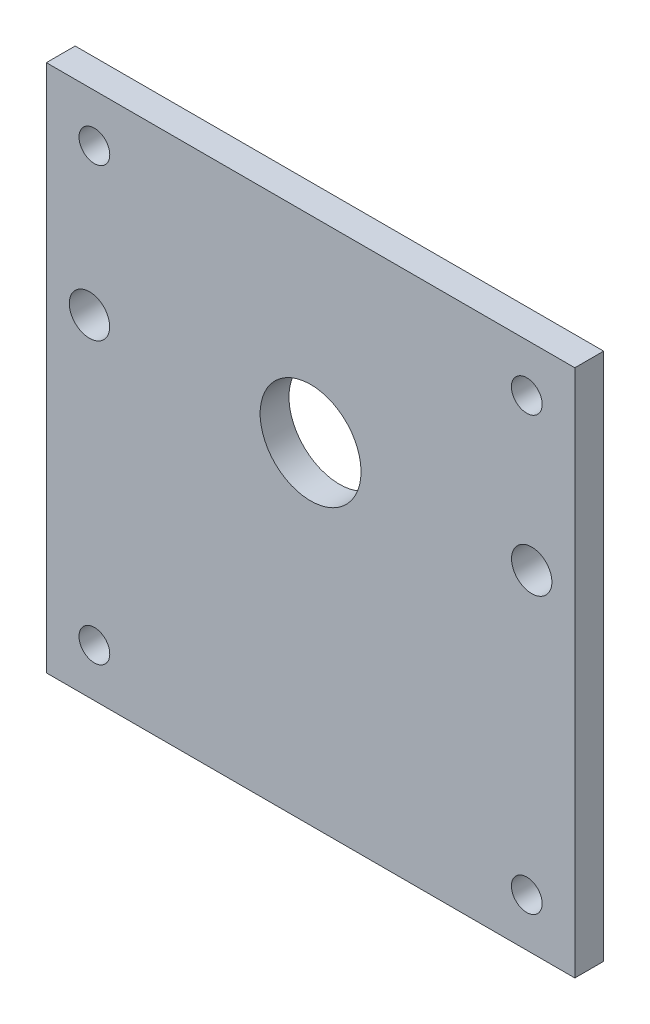
ISO-10303-21;
HEADER;
FILE_DESCRIPTION(('STEP AP214'),'2;1');
FILE_NAME('part.step','',(''),(''),'','','');
FILE_SCHEMA(('AUTOMOTIVE_DESIGN { 1 0 10303 214 1 1 1 1 }'));
ENDSEC;
DATA;
#1=APPLICATION_CONTEXT('core data for automotive mechanical design processes');
#2=APPLICATION_PROTOCOL_DEFINITION('international standard','automotive_design',2000,#1);
#3=PRODUCT_CONTEXT('',#1,'mechanical');
#4=PRODUCT('Part','Part','',(#3));
#5=PRODUCT_RELATED_PRODUCT_CATEGORY('part','',(#4));
#6=PRODUCT_DEFINITION_FORMATION('','',#4);
#7=PRODUCT_DEFINITION_CONTEXT('part definition',#1,'design');
#8=PRODUCT_DEFINITION('design','',#6,#7);
#9=PRODUCT_DEFINITION_SHAPE('','',#8);
#10=(LENGTH_UNIT() NAMED_UNIT(*) SI_UNIT(.MILLI.,.METRE.));
#11=(NAMED_UNIT(*) PLANE_ANGLE_UNIT() SI_UNIT($,.RADIAN.));
#12=(NAMED_UNIT(*) SI_UNIT($,.STERADIAN.) SOLID_ANGLE_UNIT());
#13=UNCERTAINTY_MEASURE_WITH_UNIT(LENGTH_MEASURE(1.E-05),#10,'distance_accuracy_value','');
#14=(GEOMETRIC_REPRESENTATION_CONTEXT(3) GLOBAL_UNCERTAINTY_ASSIGNED_CONTEXT((#13)) GLOBAL_UNIT_ASSIGNED_CONTEXT((#10,
#11,#12)) REPRESENTATION_CONTEXT('',''));
#15=CARTESIAN_POINT('',(0.,0.,0.));
#16=DIRECTION('',(0.,0.,1.));
#17=DIRECTION('',(1.,0.,0.));
#18=AXIS2_PLACEMENT_3D('',#15,#16,#17);
#19=CARTESIAN_POINT('',(0.,0.,3.));
#20=DIRECTION('',(0.,0.,1.));
#21=DIRECTION('',(1.,0.,0.));
#22=AXIS2_PLACEMENT_3D('',#19,#20,#21);
#23=PLANE('',#22);
#24=CARTESIAN_POINT('',(-22.5,-22.5,3.));
#25=DIRECTION('',(0.,0.,1.));
#26=DIRECTION('',(1.,0.,0.));
#27=AXIS2_PLACEMENT_3D('',#24,#25,#26);
#28=CIRCLE('',#27,1.6);
#29=CARTESIAN_POINT('',(-20.9,-22.5,3.));
#30=VERTEX_POINT('',#29);
#31=EDGE_CURVE('E170',#30,#30,#28,.T.);
#32=ORIENTED_EDGE('',*,*,#31,.F.);
#33=EDGE_LOOP('',(#32));
#34=FACE_BOUND('',#33,.T.);
#35=CARTESIAN_POINT('',(-22.5,22.5,3.));
#36=DIRECTION('',(0.,0.,1.));
#37=DIRECTION('',(1.,0.,0.));
#38=AXIS2_PLACEMENT_3D('',#35,#36,#37);
#39=CIRCLE('',#38,1.6);
#40=CARTESIAN_POINT('',(-20.9,22.5,3.));
#41=VERTEX_POINT('',#40);
#42=EDGE_CURVE('E154',#41,#41,#39,.T.);
#43=ORIENTED_EDGE('',*,*,#42,.F.);
#44=EDGE_LOOP('',(#43));
#45=FACE_BOUND('',#44,.T.);
#46=CARTESIAN_POINT('',(-23.0125,7.,3.));
#47=DIRECTION('',(0.,0.,1.));
#48=DIRECTION('',(1.,0.,0.));
#49=AXIS2_PLACEMENT_3D('',#46,#47,#48);
#50=CIRCLE('',#49,2.1);
#51=CARTESIAN_POINT('',(-20.9125,7.,3.));
#52=VERTEX_POINT('',#51);
#53=EDGE_CURVE('E138',#52,#52,#50,.T.);
#54=ORIENTED_EDGE('',*,*,#53,.F.);
#55=EDGE_LOOP('',(#54));
#56=FACE_BOUND('',#55,.T.);
#57=DIRECTION('',(0.,1.,0.));
#58=VECTOR('',#57,1.);
#59=CARTESIAN_POINT('',(27.5,27.5,3.));
#60=LINE('',#59,#58);
#61=CARTESIAN_POINT('',(27.5,-27.5,3.));
#62=VERTEX_POINT('',#61);
#63=CARTESIAN_POINT('',(27.5,27.5,3.));
#64=VERTEX_POINT('',#63);
#65=EDGE_CURVE('E96',#62,#64,#60,.T.);
#66=ORIENTED_EDGE('',*,*,#65,.T.);
#67=DIRECTION('',(-1.,0.,0.));
#68=VECTOR('',#67,1.);
#69=CARTESIAN_POINT('',(-27.5,27.5,3.));
#70=LINE('',#69,#68);
#71=CARTESIAN_POINT('',(-27.5,27.5,3.));
#72=VERTEX_POINT('',#71);
#73=EDGE_CURVE('E91',#64,#72,#70,.T.);
#74=ORIENTED_EDGE('',*,*,#73,.T.);
#75=DIRECTION('',(0.,-1.,0.));
#76=VECTOR('',#75,1.);
#77=CARTESIAN_POINT('',(-27.5,27.5,3.));
#78=LINE('',#77,#76);
#79=CARTESIAN_POINT('',(-27.5,-27.5,3.));
#80=VERTEX_POINT('',#79);
#81=EDGE_CURVE('E94',#72,#80,#78,.T.);
#82=ORIENTED_EDGE('',*,*,#81,.T.);
#83=DIRECTION('',(1.,0.,0.));
#84=VECTOR('',#83,1.);
#85=CARTESIAN_POINT('',(-27.5,-27.5,3.));
#86=LINE('',#85,#84);
#87=EDGE_CURVE('E61',#80,#62,#86,.T.);
#88=ORIENTED_EDGE('',*,*,#87,.T.);
#89=EDGE_LOOP('',(#66,#74,#82,#88));
#90=FACE_BOUND('',#89,.T.);
#91=CARTESIAN_POINT('',(0.,7.,3.));
#92=DIRECTION('',(0.,0.,1.));
#93=DIRECTION('',(1.,0.,0.));
#94=AXIS2_PLACEMENT_3D('',#91,#92,#93);
#95=CIRCLE('',#94,5.25);
#96=CARTESIAN_POINT('',(5.25,7.,3.));
#97=VERTEX_POINT('',#96);
#98=EDGE_CURVE('E116',#97,#97,#95,.T.);
#99=ORIENTED_EDGE('',*,*,#98,.F.);
#100=EDGE_LOOP('',(#99));
#101=FACE_BOUND('',#100,.T.);
#102=CARTESIAN_POINT('',(23.0125,7.,3.));
#103=DIRECTION('',(0.,0.,1.));
#104=DIRECTION('',(1.,0.,0.));
#105=AXIS2_PLACEMENT_3D('',#102,#103,#104);
#106=CIRCLE('',#105,2.1);
#107=CARTESIAN_POINT('',(25.1125,7.,3.));
#108=VERTEX_POINT('',#107);
#109=EDGE_CURVE('E146',#108,#108,#106,.T.);
#110=ORIENTED_EDGE('',*,*,#109,.F.);
#111=EDGE_LOOP('',(#110));
#112=FACE_BOUND('',#111,.T.);
#113=CARTESIAN_POINT('',(22.5,22.5,3.));
#114=DIRECTION('',(0.,0.,1.));
#115=DIRECTION('',(1.,0.,0.));
#116=AXIS2_PLACEMENT_3D('',#113,#114,#115);
#117=CIRCLE('',#116,1.6);
#118=CARTESIAN_POINT('',(24.1,22.5,3.));
#119=VERTEX_POINT('',#118);
#120=EDGE_CURVE('E162',#119,#119,#117,.T.);
#121=ORIENTED_EDGE('',*,*,#120,.F.);
#122=EDGE_LOOP('',(#121));
#123=FACE_BOUND('',#122,.T.);
#124=CARTESIAN_POINT('',(22.5,-22.5,3.));
#125=DIRECTION('',(0.,0.,1.));
#126=DIRECTION('',(1.,0.,0.));
#127=AXIS2_PLACEMENT_3D('',#124,#125,#126);
#128=CIRCLE('',#127,1.6);
#129=CARTESIAN_POINT('',(24.1,-22.5,3.));
#130=VERTEX_POINT('',#129);
#131=EDGE_CURVE('E178',#130,#130,#128,.T.);
#132=ORIENTED_EDGE('',*,*,#131,.F.);
#133=EDGE_LOOP('',(#132));
#134=FACE_BOUND('',#133,.T.);
#135=ADVANCED_FACE('F43',(#34,#45,#56,#90,#101,#112,#123,#134),#23,.T.);
#136=CARTESIAN_POINT('',(0.,0.,0.));
#137=DIRECTION('',(0.,0.,1.));
#138=DIRECTION('',(1.,0.,0.));
#139=AXIS2_PLACEMENT_3D('',#136,#137,#138);
#140=PLANE('',#139);
#141=DIRECTION('',(0.,1.,0.));
#142=VECTOR('',#141,1.);
#143=CARTESIAN_POINT('',(27.5,27.5,0.));
#144=LINE('',#143,#142);
#145=CARTESIAN_POINT('',(27.5,-27.5,0.));
#146=VERTEX_POINT('',#145);
#147=CARTESIAN_POINT('',(27.5,27.5,0.));
#148=VERTEX_POINT('',#147);
#149=EDGE_CURVE('E112',#146,#148,#144,.T.);
#150=ORIENTED_EDGE('',*,*,#149,.F.);
#151=DIRECTION('',(1.,0.,0.));
#152=VECTOR('',#151,1.);
#153=CARTESIAN_POINT('',(-27.5,-27.5,0.));
#154=LINE('',#153,#152);
#155=CARTESIAN_POINT('',(-27.5,-27.5,0.));
#156=VERTEX_POINT('',#155);
#157=EDGE_CURVE('E84',#156,#146,#154,.T.);
#158=ORIENTED_EDGE('',*,*,#157,.F.);
#159=DIRECTION('',(0.,-1.,0.));
#160=VECTOR('',#159,1.);
#161=CARTESIAN_POINT('',(-27.5,27.5,0.));
#162=LINE('',#161,#160);
#163=CARTESIAN_POINT('',(-27.5,27.5,0.));
#164=VERTEX_POINT('',#163);
#165=EDGE_CURVE('E78',#164,#156,#162,.T.);
#166=ORIENTED_EDGE('',*,*,#165,.F.);
#167=DIRECTION('',(-1.,0.,0.));
#168=VECTOR('',#167,1.);
#169=CARTESIAN_POINT('',(-27.5,27.5,0.));
#170=LINE('',#169,#168);
#171=EDGE_CURVE('E101',#148,#164,#170,.T.);
#172=ORIENTED_EDGE('',*,*,#171,.F.);
#173=EDGE_LOOP('',(#150,#158,#166,#172));
#174=FACE_BOUND('',#173,.T.);
#175=CARTESIAN_POINT('',(0.,7.,0.));
#176=DIRECTION('',(0.,0.,1.));
#177=DIRECTION('',(1.,0.,0.));
#178=AXIS2_PLACEMENT_3D('',#175,#176,#177);
#179=CIRCLE('',#178,5.25);
#180=CARTESIAN_POINT('',(5.25,7.,0.));
#181=VERTEX_POINT('',#180);
#182=EDGE_CURVE('E134',#181,#181,#179,.T.);
#183=ORIENTED_EDGE('',*,*,#182,.T.);
#184=EDGE_LOOP('',(#183));
#185=FACE_BOUND('',#184,.T.);
#186=CARTESIAN_POINT('',(-23.0125,7.,0.));
#187=DIRECTION('',(0.,0.,1.));
#188=DIRECTION('',(1.,0.,0.));
#189=AXIS2_PLACEMENT_3D('',#186,#187,#188);
#190=CIRCLE('',#189,2.1);
#191=CARTESIAN_POINT('',(-20.9125,7.,0.));
#192=VERTEX_POINT('',#191);
#193=EDGE_CURVE('E142',#192,#192,#190,.T.);
#194=ORIENTED_EDGE('',*,*,#193,.T.);
#195=EDGE_LOOP('',(#194));
#196=FACE_BOUND('',#195,.T.);
#197=CARTESIAN_POINT('',(23.0125,7.,0.));
#198=DIRECTION('',(0.,0.,1.));
#199=DIRECTION('',(1.,0.,0.));
#200=AXIS2_PLACEMENT_3D('',#197,#198,#199);
#201=CIRCLE('',#200,2.1);
#202=CARTESIAN_POINT('',(25.1125,7.,0.));
#203=VERTEX_POINT('',#202);
#204=EDGE_CURVE('E150',#203,#203,#201,.T.);
#205=ORIENTED_EDGE('',*,*,#204,.T.);
#206=EDGE_LOOP('',(#205));
#207=FACE_BOUND('',#206,.T.);
#208=CARTESIAN_POINT('',(-22.5,22.5,0.));
#209=DIRECTION('',(0.,0.,1.));
#210=DIRECTION('',(1.,0.,0.));
#211=AXIS2_PLACEMENT_3D('',#208,#209,#210);
#212=CIRCLE('',#211,1.6);
#213=CARTESIAN_POINT('',(-20.9,22.5,0.));
#214=VERTEX_POINT('',#213);
#215=EDGE_CURVE('E158',#214,#214,#212,.T.);
#216=ORIENTED_EDGE('',*,*,#215,.T.);
#217=EDGE_LOOP('',(#216));
#218=FACE_BOUND('',#217,.T.);
#219=CARTESIAN_POINT('',(22.5,22.5,0.));
#220=DIRECTION('',(0.,0.,1.));
#221=DIRECTION('',(1.,0.,0.));
#222=AXIS2_PLACEMENT_3D('',#219,#220,#221);
#223=CIRCLE('',#222,1.6);
#224=CARTESIAN_POINT('',(24.1,22.5,0.));
#225=VERTEX_POINT('',#224);
#226=EDGE_CURVE('E166',#225,#225,#223,.T.);
#227=ORIENTED_EDGE('',*,*,#226,.T.);
#228=EDGE_LOOP('',(#227));
#229=FACE_BOUND('',#228,.T.);
#230=CARTESIAN_POINT('',(-22.5,-22.5,0.));
#231=DIRECTION('',(0.,0.,1.));
#232=DIRECTION('',(1.,0.,0.));
#233=AXIS2_PLACEMENT_3D('',#230,#231,#232);
#234=CIRCLE('',#233,1.6);
#235=CARTESIAN_POINT('',(-20.9,-22.5,0.));
#236=VERTEX_POINT('',#235);
#237=EDGE_CURVE('E174',#236,#236,#234,.T.);
#238=ORIENTED_EDGE('',*,*,#237,.T.);
#239=EDGE_LOOP('',(#238));
#240=FACE_BOUND('',#239,.T.);
#241=CARTESIAN_POINT('',(22.5,-22.5,0.));
#242=DIRECTION('',(0.,0.,1.));
#243=DIRECTION('',(1.,0.,0.));
#244=AXIS2_PLACEMENT_3D('',#241,#242,#243);
#245=CIRCLE('',#244,1.6);
#246=CARTESIAN_POINT('',(24.1,-22.5,0.));
#247=VERTEX_POINT('',#246);
#248=EDGE_CURVE('E182',#247,#247,#245,.T.);
#249=ORIENTED_EDGE('',*,*,#248,.T.);
#250=EDGE_LOOP('',(#249));
#251=FACE_BOUND('',#250,.T.);
#252=ADVANCED_FACE('F129',(#174,#185,#196,#207,#218,#229,#240,#251),#140,.F.);
#253=CARTESIAN_POINT('',(27.5,27.5,3.));
#254=DIRECTION('',(-1.,0.,0.));
#255=DIRECTION('',(0.,-1.,0.));
#256=AXIS2_PLACEMENT_3D('',#253,#254,#255);
#257=PLANE('',#256);
#258=ORIENTED_EDGE('',*,*,#149,.T.);
#259=DIRECTION('',(0.,0.,-1.));
#260=VECTOR('',#259,1.);
#261=CARTESIAN_POINT('',(27.5,27.5,3.));
#262=LINE('',#261,#260);
#263=EDGE_CURVE('E11',#64,#148,#262,.T.);
#264=ORIENTED_EDGE('',*,*,#263,.F.);
#265=ORIENTED_EDGE('',*,*,#65,.F.);
#266=DIRECTION('',(0.,0.,-1.));
#267=VECTOR('',#266,1.);
#268=CARTESIAN_POINT('',(27.5,-27.5,3.));
#269=LINE('',#268,#267);
#270=EDGE_CURVE('E108',#62,#146,#269,.T.);
#271=ORIENTED_EDGE('',*,*,#270,.T.);
#272=EDGE_LOOP('',(#258,#264,#265,#271));
#273=FACE_BOUND('',#272,.T.);
#274=ADVANCED_FACE('F45',(#273),#257,.F.);
#275=CARTESIAN_POINT('',(-27.5,27.5,3.));
#276=DIRECTION('',(0.,-1.,0.));
#277=DIRECTION('',(0.,0.,-1.));
#278=AXIS2_PLACEMENT_3D('',#275,#276,#277);
#279=PLANE('',#278);
#280=ORIENTED_EDGE('',*,*,#171,.T.);
#281=DIRECTION('',(0.,0.,-1.));
#282=VECTOR('',#281,1.);
#283=CARTESIAN_POINT('',(-27.5,27.5,3.));
#284=LINE('',#283,#282);
#285=EDGE_CURVE('E53',#72,#164,#284,.T.);
#286=ORIENTED_EDGE('',*,*,#285,.F.);
#287=ORIENTED_EDGE('',*,*,#73,.F.);
#288=ORIENTED_EDGE('',*,*,#263,.T.);
#289=EDGE_LOOP('',(#280,#286,#287,#288));
#290=FACE_BOUND('',#289,.T.);
#291=ADVANCED_FACE('F100',(#290),#279,.F.);
#292=CARTESIAN_POINT('',(-27.5,27.5,3.));
#293=DIRECTION('',(1.,0.,0.));
#294=DIRECTION('',(0.,1.,0.));
#295=AXIS2_PLACEMENT_3D('',#292,#293,#294);
#296=PLANE('',#295);
#297=ORIENTED_EDGE('',*,*,#165,.T.);
#298=DIRECTION('',(0.,0.,-1.));
#299=VECTOR('',#298,1.);
#300=CARTESIAN_POINT('',(-27.5,-27.5,3.));
#301=LINE('',#300,#299);
#302=EDGE_CURVE('E103',#80,#156,#301,.T.);
#303=ORIENTED_EDGE('',*,*,#302,.F.);
#304=ORIENTED_EDGE('',*,*,#81,.F.);
#305=ORIENTED_EDGE('',*,*,#285,.T.);
#306=EDGE_LOOP('',(#297,#303,#304,#305));
#307=FACE_BOUND('',#306,.T.);
#308=ADVANCED_FACE('F104',(#307),#296,.F.);
#309=CARTESIAN_POINT('',(-27.5,-27.5,3.));
#310=DIRECTION('',(0.,1.,0.));
#311=DIRECTION('',(0.,0.,1.));
#312=AXIS2_PLACEMENT_3D('',#309,#310,#311);
#313=PLANE('',#312);
#314=ORIENTED_EDGE('',*,*,#157,.T.);
#315=ORIENTED_EDGE('',*,*,#270,.F.);
#316=ORIENTED_EDGE('',*,*,#87,.F.);
#317=ORIENTED_EDGE('',*,*,#302,.T.);
#318=EDGE_LOOP('',(#314,#315,#316,#317));
#319=FACE_BOUND('',#318,.T.);
#320=ADVANCED_FACE('F126',(#319),#313,.F.);
#321=CARTESIAN_POINT('',(0.,7.,3.));
#322=DIRECTION('',(0.,0.,-1.));
#323=DIRECTION('',(-1.,0.,0.));
#324=AXIS2_PLACEMENT_3D('',#321,#322,#323);
#325=CYLINDRICAL_SURFACE('',#324,5.25);
#326=ORIENTED_EDGE('',*,*,#98,.T.);
#327=EDGE_LOOP('',(#326));
#328=FACE_BOUND('',#327,.T.);
#329=ORIENTED_EDGE('',*,*,#182,.F.);
#330=EDGE_LOOP('',(#329));
#331=FACE_BOUND('',#330,.T.);
#332=ADVANCED_FACE('F203',(#328,#331),#325,.F.);
#333=CARTESIAN_POINT('',(-23.0125,7.,3.));
#334=DIRECTION('',(0.,0.,-1.));
#335=DIRECTION('',(-1.,0.,0.));
#336=AXIS2_PLACEMENT_3D('',#333,#334,#335);
#337=CYLINDRICAL_SURFACE('',#336,2.1);
#338=ORIENTED_EDGE('',*,*,#53,.T.);
#339=EDGE_LOOP('',(#338));
#340=FACE_BOUND('',#339,.T.);
#341=ORIENTED_EDGE('',*,*,#193,.F.);
#342=EDGE_LOOP('',(#341));
#343=FACE_BOUND('',#342,.T.);
#344=ADVANCED_FACE('F257',(#340,#343),#337,.F.);
#345=CARTESIAN_POINT('',(23.0125,7.,3.));
#346=DIRECTION('',(0.,0.,-1.));
#347=DIRECTION('',(-1.,0.,0.));
#348=AXIS2_PLACEMENT_3D('',#345,#346,#347);
#349=CYLINDRICAL_SURFACE('',#348,2.1);
#350=ORIENTED_EDGE('',*,*,#109,.T.);
#351=EDGE_LOOP('',(#350));
#352=FACE_BOUND('',#351,.T.);
#353=ORIENTED_EDGE('',*,*,#204,.F.);
#354=EDGE_LOOP('',(#353));
#355=FACE_BOUND('',#354,.T.);
#356=ADVANCED_FACE('F266',(#352,#355),#349,.F.);
#357=CARTESIAN_POINT('',(-22.5,22.5,3.));
#358=DIRECTION('',(0.,0.,-1.));
#359=DIRECTION('',(-1.,0.,0.));
#360=AXIS2_PLACEMENT_3D('',#357,#358,#359);
#361=CYLINDRICAL_SURFACE('',#360,1.6);
#362=ORIENTED_EDGE('',*,*,#42,.T.);
#363=EDGE_LOOP('',(#362));
#364=FACE_BOUND('',#363,.T.);
#365=ORIENTED_EDGE('',*,*,#215,.F.);
#366=EDGE_LOOP('',(#365));
#367=FACE_BOUND('',#366,.T.);
#368=ADVANCED_FACE('F275',(#364,#367),#361,.F.);
#369=CARTESIAN_POINT('',(22.5,22.5,3.));
#370=DIRECTION('',(0.,0.,-1.));
#371=DIRECTION('',(-1.,0.,0.));
#372=AXIS2_PLACEMENT_3D('',#369,#370,#371);
#373=CYLINDRICAL_SURFACE('',#372,1.6);
#374=ORIENTED_EDGE('',*,*,#120,.T.);
#375=EDGE_LOOP('',(#374));
#376=FACE_BOUND('',#375,.T.);
#377=ORIENTED_EDGE('',*,*,#226,.F.);
#378=EDGE_LOOP('',(#377));
#379=FACE_BOUND('',#378,.T.);
#380=ADVANCED_FACE('F285',(#376,#379),#373,.F.);
#381=CARTESIAN_POINT('',(-22.5,-22.5,3.));
#382=DIRECTION('',(0.,0.,-1.));
#383=DIRECTION('',(-1.,0.,0.));
#384=AXIS2_PLACEMENT_3D('',#381,#382,#383);
#385=CYLINDRICAL_SURFACE('',#384,1.6);
#386=ORIENTED_EDGE('',*,*,#31,.T.);
#387=EDGE_LOOP('',(#386));
#388=FACE_BOUND('',#387,.T.);
#389=ORIENTED_EDGE('',*,*,#237,.F.);
#390=EDGE_LOOP('',(#389));
#391=FACE_BOUND('',#390,.T.);
#392=ADVANCED_FACE('F295',(#388,#391),#385,.F.);
#393=CARTESIAN_POINT('',(22.5,-22.5,3.));
#394=DIRECTION('',(0.,0.,-1.));
#395=DIRECTION('',(-1.,0.,0.));
#396=AXIS2_PLACEMENT_3D('',#393,#394,#395);
#397=CYLINDRICAL_SURFACE('',#396,1.6);
#398=ORIENTED_EDGE('',*,*,#131,.T.);
#399=EDGE_LOOP('',(#398));
#400=FACE_BOUND('',#399,.T.);
#401=ORIENTED_EDGE('',*,*,#248,.F.);
#402=EDGE_LOOP('',(#401));
#403=FACE_BOUND('',#402,.T.);
#404=ADVANCED_FACE('F190',(#400,#403),#397,.F.);
#405=CLOSED_SHELL('',(#135,#252,#274,#291,#308,#320,#332,#344,#356,#368,#380,#392,#404));
#406=MANIFOLD_SOLID_BREP('B2',#405);
#407=ADVANCED_BREP_SHAPE_REPRESENTATION('',(#18,#406),#14);
#408=SHAPE_DEFINITION_REPRESENTATION(#9,#407);
ENDSEC;
END-ISO-10303-21;
